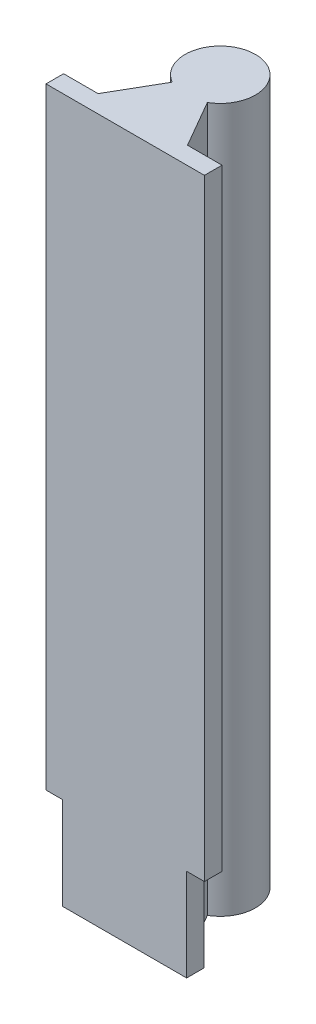
ISO-10303-21;
HEADER;
FILE_DESCRIPTION(('STEP AP214'),'2;1');
FILE_NAME('part.step','',(''),(''),'','','');
FILE_SCHEMA(('AUTOMOTIVE_DESIGN { 1 0 10303 214 1 1 1 1 }'));
ENDSEC;
DATA;
#1=APPLICATION_CONTEXT('core data for automotive mechanical design processes');
#2=APPLICATION_PROTOCOL_DEFINITION('international standard','automotive_design',2000,#1);
#3=PRODUCT_CONTEXT('',#1,'mechanical');
#4=PRODUCT('Part','Part','',(#3));
#5=PRODUCT_RELATED_PRODUCT_CATEGORY('part','',(#4));
#6=PRODUCT_DEFINITION_FORMATION('','',#4);
#7=PRODUCT_DEFINITION_CONTEXT('part definition',#1,'design');
#8=PRODUCT_DEFINITION('design','',#6,#7);
#9=PRODUCT_DEFINITION_SHAPE('','',#8);
#10=(LENGTH_UNIT() NAMED_UNIT(*) SI_UNIT(.MILLI.,.METRE.));
#11=(NAMED_UNIT(*) PLANE_ANGLE_UNIT() SI_UNIT($,.RADIAN.));
#12=(NAMED_UNIT(*) SI_UNIT($,.STERADIAN.) SOLID_ANGLE_UNIT());
#13=UNCERTAINTY_MEASURE_WITH_UNIT(LENGTH_MEASURE(1.E-05),#10,'distance_accuracy_value','');
#14=(GEOMETRIC_REPRESENTATION_CONTEXT(3) GLOBAL_UNCERTAINTY_ASSIGNED_CONTEXT((#13)) GLOBAL_UNIT_ASSIGNED_CONTEXT((#10,
#11,#12)) REPRESENTATION_CONTEXT('',''));
#15=CARTESIAN_POINT('',(0.,0.,0.));
#16=DIRECTION('',(0.,0.,1.));
#17=DIRECTION('',(1.,0.,0.));
#18=AXIS2_PLACEMENT_3D('',#15,#16,#17);
#19=CARTESIAN_POINT('',(-12.7017059221718,200.,-2.5));
#20=DIRECTION('',(0.,0.,1.));
#21=DIRECTION('',(1.,0.,0.));
#22=AXIS2_PLACEMENT_3D('',#19,#20,#21);
#23=PLANE('',#22);
#24=DIRECTION('',(-1.,0.,0.));
#25=VECTOR('',#24,1.);
#26=CARTESIAN_POINT('',(-12.7017059221718,0.,-2.5));
#27=LINE('',#26,#25);
#28=CARTESIAN_POINT('',(-12.7017059221718,0.,-2.5));
#29=VERTEX_POINT('',#28);
#30=CARTESIAN_POINT('',(-17.8840594454055,0.,-2.5));
#31=VERTEX_POINT('',#30);
#32=EDGE_CURVE('E160',#29,#31,#27,.T.);
#33=ORIENTED_EDGE('',*,*,#32,.T.);
#34=DIRECTION('',(0.,-1.,0.));
#35=VECTOR('',#34,1.);
#36=CARTESIAN_POINT('',(-17.8840594454055,-2.6813725433712,-2.5));
#37=LINE('',#36,#35);
#38=CARTESIAN_POINT('',(-17.8840594454055,26.2548562329599,-2.5));
#39=VERTEX_POINT('',#38);
#40=EDGE_CURVE('E54',#39,#31,#37,.T.);
#41=ORIENTED_EDGE('',*,*,#40,.F.);
#42=DIRECTION('',(1.,0.,0.));
#43=VECTOR('',#42,1.);
#44=CARTESIAN_POINT('',(-27.1159405545945,26.2548562329599,-2.5));
#45=LINE('',#44,#43);
#46=CARTESIAN_POINT('',(-22.5,26.2548562329599,-2.5));
#47=VERTEX_POINT('',#46);
#48=EDGE_CURVE('E150',#47,#39,#45,.T.);
#49=ORIENTED_EDGE('',*,*,#48,.F.);
#50=DIRECTION('',(0.,-1.,0.));
#51=VECTOR('',#50,1.);
#52=CARTESIAN_POINT('',(-22.5,200.,-2.5));
#53=LINE('',#52,#51);
#54=CARTESIAN_POINT('',(-22.5,200.,-2.5));
#55=VERTEX_POINT('',#54);
#56=EDGE_CURVE('E209',#55,#47,#53,.T.);
#57=ORIENTED_EDGE('',*,*,#56,.F.);
#58=DIRECTION('',(-1.,0.,0.));
#59=VECTOR('',#58,1.);
#60=CARTESIAN_POINT('',(-12.7017059221718,200.,-2.5));
#61=LINE('',#60,#59);
#62=CARTESIAN_POINT('',(-12.7017059221718,200.,-2.5));
#63=VERTEX_POINT('',#62);
#64=EDGE_CURVE('E161',#63,#55,#61,.T.);
#65=ORIENTED_EDGE('',*,*,#64,.F.);
#66=DIRECTION('',(0.,-1.,0.));
#67=VECTOR('',#66,1.);
#68=CARTESIAN_POINT('',(-12.7017059221718,200.,-2.5));
#69=LINE('',#68,#67);
#70=EDGE_CURVE('E179',#63,#29,#69,.T.);
#71=ORIENTED_EDGE('',*,*,#70,.T.);
#72=EDGE_LOOP('',(#33,#41,#49,#57,#65,#71));
#73=FACE_BOUND('',#72,.T.);
#74=ADVANCED_FACE('F33',(#73),#23,.F.);
#75=CARTESIAN_POINT('',(-22.5,200.,2.5));
#76=DIRECTION('',(1.,0.,0.));
#77=DIRECTION('',(0.,0.,-1.));
#78=AXIS2_PLACEMENT_3D('',#75,#76,#77);
#79=PLANE('',#78);
#80=ORIENTED_EDGE('',*,*,#56,.T.);
#81=DIRECTION('',(0.,0.,1.));
#82=VECTOR('',#81,1.);
#83=CARTESIAN_POINT('',(-22.5,26.2548562329599,2.5));
#84=LINE('',#83,#82);
#85=CARTESIAN_POINT('',(-22.5,26.2548562329599,2.5));
#86=VERTEX_POINT('',#85);
#87=EDGE_CURVE('E157',#47,#86,#84,.T.);
#88=ORIENTED_EDGE('',*,*,#87,.T.);
#89=DIRECTION('',(0.,-1.,0.));
#90=VECTOR('',#89,1.);
#91=CARTESIAN_POINT('',(-22.5,200.,2.5));
#92=LINE('',#91,#90);
#93=CARTESIAN_POINT('',(-22.5,200.,2.5));
#94=VERTEX_POINT('',#93);
#95=EDGE_CURVE('E206',#94,#86,#92,.T.);
#96=ORIENTED_EDGE('',*,*,#95,.F.);
#97=DIRECTION('',(0.,0.,1.));
#98=VECTOR('',#97,1.);
#99=CARTESIAN_POINT('',(-22.5,200.,2.5));
#100=LINE('',#99,#98);
#101=EDGE_CURVE('E164',#55,#94,#100,.T.);
#102=ORIENTED_EDGE('',*,*,#101,.F.);
#103=EDGE_LOOP('',(#80,#88,#96,#102));
#104=FACE_BOUND('',#103,.T.);
#105=ADVANCED_FACE('F248',(#104),#79,.F.);
#106=CARTESIAN_POINT('',(22.5,200.,2.5));
#107=DIRECTION('',(0.,0.,-1.));
#108=DIRECTION('',(-1.,0.,0.));
#109=AXIS2_PLACEMENT_3D('',#106,#107,#108);
#110=PLANE('',#109);
#111=DIRECTION('',(1.,0.,0.));
#112=VECTOR('',#111,1.);
#113=CARTESIAN_POINT('',(22.5,0.,2.5));
#114=LINE('',#113,#112);
#115=CARTESIAN_POINT('',(-17.8840594454055,0.,2.5));
#116=VERTEX_POINT('',#115);
#117=CARTESIAN_POINT('',(17.4535805631937,0.,2.5));
#118=VERTEX_POINT('',#117);
#119=EDGE_CURVE('E140',#116,#118,#114,.T.);
#120=ORIENTED_EDGE('',*,*,#119,.T.);
#121=DIRECTION('',(0.,1.,0.));
#122=VECTOR('',#121,1.);
#123=CARTESIAN_POINT('',(17.4535805631937,-2.6813725433712,2.50000000000001));
#124=LINE('',#123,#122);
#125=CARTESIAN_POINT('',(17.4535805631937,26.2548562329599,2.50000000000001));
#126=VERTEX_POINT('',#125);
#127=EDGE_CURVE('E47',#118,#126,#124,.T.);
#128=ORIENTED_EDGE('',*,*,#127,.T.);
#129=DIRECTION('',(1.,0.,0.));
#130=VECTOR('',#129,1.);
#131=CARTESIAN_POINT('',(27.5464194368063,26.2548562329599,2.50000000000001));
#132=LINE('',#131,#130);
#133=CARTESIAN_POINT('',(22.5,26.2548562329599,2.50000000000001));
#134=VERTEX_POINT('',#133);
#135=EDGE_CURVE('E127',#126,#134,#132,.T.);
#136=ORIENTED_EDGE('',*,*,#135,.T.);
#137=DIRECTION('',(0.,-1.,0.));
#138=VECTOR('',#137,1.);
#139=CARTESIAN_POINT('',(22.5,200.,2.5));
#140=LINE('',#139,#138);
#141=CARTESIAN_POINT('',(22.5,200.,2.5));
#142=VERTEX_POINT('',#141);
#143=EDGE_CURVE('E204',#142,#134,#140,.T.);
#144=ORIENTED_EDGE('',*,*,#143,.F.);
#145=DIRECTION('',(1.,0.,0.));
#146=VECTOR('',#145,1.);
#147=CARTESIAN_POINT('',(22.5,200.,2.5));
#148=LINE('',#147,#146);
#149=EDGE_CURVE('E167',#94,#142,#148,.T.);
#150=ORIENTED_EDGE('',*,*,#149,.F.);
#151=ORIENTED_EDGE('',*,*,#95,.T.);
#152=DIRECTION('',(1.,0.,0.));
#153=VECTOR('',#152,1.);
#154=CARTESIAN_POINT('',(-27.1159405545945,26.2548562329599,2.5));
#155=LINE('',#154,#153);
#156=CARTESIAN_POINT('',(-17.8840594454055,26.2548562329599,2.5));
#157=VERTEX_POINT('',#156);
#158=EDGE_CURVE('E149',#86,#157,#155,.T.);
#159=ORIENTED_EDGE('',*,*,#158,.T.);
#160=DIRECTION('',(0.,-1.,0.));
#161=VECTOR('',#160,1.);
#162=CARTESIAN_POINT('',(-17.8840594454055,-2.6813725433712,2.5));
#163=LINE('',#162,#161);
#164=EDGE_CURVE('E147',#157,#116,#163,.T.);
#165=ORIENTED_EDGE('',*,*,#164,.T.);
#166=EDGE_LOOP('',(#120,#128,#136,#144,#150,#151,#159,#165));
#167=FACE_BOUND('',#166,.T.);
#168=ADVANCED_FACE('F137',(#167),#110,.F.);
#169=CARTESIAN_POINT('',(22.5,200.,2.5));
#170=DIRECTION('',(-1.,0.,0.));
#171=DIRECTION('',(0.,0.,1.));
#172=AXIS2_PLACEMENT_3D('',#169,#170,#171);
#173=PLANE('',#172);
#174=ORIENTED_EDGE('',*,*,#143,.T.);
#175=DIRECTION('',(0.,0.,-1.));
#176=VECTOR('',#175,1.);
#177=CARTESIAN_POINT('',(22.5,26.2548562329599,2.5));
#178=LINE('',#177,#176);
#179=CARTESIAN_POINT('',(22.5,26.2548562329599,-2.49999999999999));
#180=VERTEX_POINT('',#179);
#181=EDGE_CURVE('E126',#134,#180,#178,.T.);
#182=ORIENTED_EDGE('',*,*,#181,.T.);
#183=DIRECTION('',(0.,-1.,0.));
#184=VECTOR('',#183,1.);
#185=CARTESIAN_POINT('',(22.5,200.,-2.5));
#186=LINE('',#185,#184);
#187=CARTESIAN_POINT('',(22.5,200.,-2.5));
#188=VERTEX_POINT('',#187);
#189=EDGE_CURVE('E201',#188,#180,#186,.T.);
#190=ORIENTED_EDGE('',*,*,#189,.F.);
#191=DIRECTION('',(0.,0.,-1.));
#192=VECTOR('',#191,1.);
#193=CARTESIAN_POINT('',(22.5,200.,2.5));
#194=LINE('',#193,#192);
#195=EDGE_CURVE('E169',#142,#188,#194,.T.);
#196=ORIENTED_EDGE('',*,*,#195,.F.);
#197=EDGE_LOOP('',(#174,#182,#190,#196));
#198=FACE_BOUND('',#197,.T.);
#199=ADVANCED_FACE('F241',(#198),#173,.F.);
#200=CARTESIAN_POINT('',(22.5,200.,-2.5));
#201=DIRECTION('',(0.,0.,1.));
#202=DIRECTION('',(1.,0.,0.));
#203=AXIS2_PLACEMENT_3D('',#200,#201,#202);
#204=PLANE('',#203);
#205=DIRECTION('',(1.,0.,0.));
#206=VECTOR('',#205,1.);
#207=CARTESIAN_POINT('',(27.5464194368063,26.2548562329599,-2.49999999999999));
#208=LINE('',#207,#206);
#209=CARTESIAN_POINT('',(17.4535805631937,26.2548562329599,-2.49999999999999));
#210=VERTEX_POINT('',#209);
#211=EDGE_CURVE('E141',#210,#180,#208,.T.);
#212=ORIENTED_EDGE('',*,*,#211,.F.);
#213=DIRECTION('',(0.,1.,0.));
#214=VECTOR('',#213,1.);
#215=CARTESIAN_POINT('',(17.4535805631937,-2.6813725433712,-2.49999999999999));
#216=LINE('',#215,#214);
#217=CARTESIAN_POINT('',(17.4535805631937,0.,-2.49999999999999));
#218=VERTEX_POINT('',#217);
#219=EDGE_CURVE('E123',#218,#210,#216,.T.);
#220=ORIENTED_EDGE('',*,*,#219,.F.);
#221=DIRECTION('',(-1.,0.,0.));
#222=VECTOR('',#221,1.);
#223=CARTESIAN_POINT('',(22.5,0.,-2.5));
#224=LINE('',#223,#222);
#225=CARTESIAN_POINT('',(12.7017059221718,0.,-2.5));
#226=VERTEX_POINT('',#225);
#227=EDGE_CURVE('E183',#218,#226,#224,.T.);
#228=ORIENTED_EDGE('',*,*,#227,.T.);
#229=DIRECTION('',(0.,-1.,0.));
#230=VECTOR('',#229,1.);
#231=CARTESIAN_POINT('',(12.7017059221718,200.,-2.5));
#232=LINE('',#231,#230);
#233=CARTESIAN_POINT('',(12.7017059221718,200.,-2.5));
#234=VERTEX_POINT('',#233);
#235=EDGE_CURVE('E198',#234,#226,#232,.T.);
#236=ORIENTED_EDGE('',*,*,#235,.F.);
#237=DIRECTION('',(-1.,0.,0.));
#238=VECTOR('',#237,1.);
#239=CARTESIAN_POINT('',(22.5,200.,-2.5));
#240=LINE('',#239,#238);
#241=EDGE_CURVE('E171',#188,#234,#240,.T.);
#242=ORIENTED_EDGE('',*,*,#241,.F.);
#243=ORIENTED_EDGE('',*,*,#189,.T.);
#244=EDGE_LOOP('',(#212,#220,#228,#236,#242,#243));
#245=FACE_BOUND('',#244,.T.);
#246=ADVANCED_FACE('F238',(#245),#204,.F.);
#247=CARTESIAN_POINT('',(5.00000000000002,200.,-15.8397459621556));
#248=DIRECTION('',(-0.866025403784438,0.,0.500000000000001));
#249=DIRECTION('',(0.500000000000001,0.,0.866025403784438));
#250=AXIS2_PLACEMENT_3D('',#247,#248,#249);
#251=PLANE('',#250);
#252=DIRECTION('',(-0.500000000000001,0.,-0.866025403784438));
#253=VECTOR('',#252,1.);
#254=CARTESIAN_POINT('',(5.00000000000002,0.,-15.8397459621556));
#255=LINE('',#254,#253);
#256=CARTESIAN_POINT('',(5.00000000000002,0.,-15.8397459621556));
#257=VERTEX_POINT('',#256);
#258=EDGE_CURVE('E185',#226,#257,#255,.T.);
#259=ORIENTED_EDGE('',*,*,#258,.T.);
#260=DIRECTION('',(0.,-1.,0.));
#261=VECTOR('',#260,1.);
#262=CARTESIAN_POINT('',(5.00000000000002,200.,-15.8397459621556));
#263=LINE('',#262,#261);
#264=CARTESIAN_POINT('',(5.00000000000002,200.,-15.8397459621556));
#265=VERTEX_POINT('',#264);
#266=EDGE_CURVE('E195',#265,#257,#263,.T.);
#267=ORIENTED_EDGE('',*,*,#266,.F.);
#268=DIRECTION('',(-0.500000000000001,0.,-0.866025403784438));
#269=VECTOR('',#268,1.);
#270=CARTESIAN_POINT('',(5.00000000000002,200.,-15.8397459621556));
#271=LINE('',#270,#269);
#272=EDGE_CURVE('E173',#234,#265,#271,.T.);
#273=ORIENTED_EDGE('',*,*,#272,.F.);
#274=ORIENTED_EDGE('',*,*,#235,.T.);
#275=EDGE_LOOP('',(#259,#267,#273,#274));
#276=FACE_BOUND('',#275,.T.);
#277=ADVANCED_FACE('F234',(#276),#251,.F.);
#278=CARTESIAN_POINT('',(0.,200.,-24.5));
#279=DIRECTION('',(0.,-1.,0.));
#280=DIRECTION('',(0.,0.,-1.));
#281=AXIS2_PLACEMENT_3D('',#278,#279,#280);
#282=CYLINDRICAL_SURFACE('',#281,10.);
#283=CARTESIAN_POINT('',(0.,0.,-24.5));
#284=DIRECTION('',(0.,1.,0.));
#285=DIRECTION('',(0.,0.,1.));
#286=AXIS2_PLACEMENT_3D('',#283,#284,#285);
#287=CIRCLE('',#286,10.);
#288=CARTESIAN_POINT('',(-5.00000000000002,0.,-15.8397459621556));
#289=VERTEX_POINT('',#288);
#290=EDGE_CURVE('E187',#257,#289,#287,.T.);
#291=ORIENTED_EDGE('',*,*,#290,.T.);
#292=DIRECTION('',(0.,-1.,0.));
#293=VECTOR('',#292,1.);
#294=CARTESIAN_POINT('',(-5.00000000000002,200.,-15.8397459621556));
#295=LINE('',#294,#293);
#296=CARTESIAN_POINT('',(-5.00000000000002,200.,-15.8397459621556));
#297=VERTEX_POINT('',#296);
#298=EDGE_CURVE('E192',#297,#289,#295,.T.);
#299=ORIENTED_EDGE('',*,*,#298,.F.);
#300=CARTESIAN_POINT('',(0.,200.,-24.5));
#301=DIRECTION('',(0.,1.,0.));
#302=DIRECTION('',(0.,0.,1.));
#303=AXIS2_PLACEMENT_3D('',#300,#301,#302);
#304=CIRCLE('',#303,10.);
#305=EDGE_CURVE('E175',#265,#297,#304,.T.);
#306=ORIENTED_EDGE('',*,*,#305,.F.);
#307=ORIENTED_EDGE('',*,*,#266,.T.);
#308=EDGE_LOOP('',(#291,#299,#306,#307));
#309=FACE_BOUND('',#308,.T.);
#310=ADVANCED_FACE('F229',(#309),#282,.T.);
#311=CARTESIAN_POINT('',(-5.00000000000001,200.,-15.8397459621556));
#312=DIRECTION('',(0.866025403784438,0.,0.500000000000001));
#313=DIRECTION('',(0.500000000000001,0.,-0.866025403784438));
#314=AXIS2_PLACEMENT_3D('',#311,#312,#313);
#315=PLANE('',#314);
#316=DIRECTION('',(-0.500000000000001,0.,0.866025403784438));
#317=VECTOR('',#316,1.);
#318=CARTESIAN_POINT('',(-5.00000000000001,0.,-15.8397459621556));
#319=LINE('',#318,#317);
#320=EDGE_CURVE('E165',#289,#29,#319,.T.);
#321=ORIENTED_EDGE('',*,*,#320,.T.);
#322=ORIENTED_EDGE('',*,*,#70,.F.);
#323=DIRECTION('',(-0.500000000000001,0.,0.866025403784438));
#324=VECTOR('',#323,1.);
#325=CARTESIAN_POINT('',(-5.00000000000001,200.,-15.8397459621556));
#326=LINE('',#325,#324);
#327=EDGE_CURVE('E177',#297,#63,#326,.T.);
#328=ORIENTED_EDGE('',*,*,#327,.F.);
#329=ORIENTED_EDGE('',*,*,#298,.T.);
#330=EDGE_LOOP('',(#321,#322,#328,#329));
#331=FACE_BOUND('',#330,.T.);
#332=ADVANCED_FACE('F224',(#331),#315,.F.);
#333=CARTESIAN_POINT('',(0.,200.,-24.5));
#334=DIRECTION('',(0.,1.,0.));
#335=DIRECTION('',(0.,0.,1.));
#336=AXIS2_PLACEMENT_3D('',#333,#334,#335);
#337=PLANE('',#336);
#338=ORIENTED_EDGE('',*,*,#64,.T.);
#339=ORIENTED_EDGE('',*,*,#101,.T.);
#340=ORIENTED_EDGE('',*,*,#149,.T.);
#341=ORIENTED_EDGE('',*,*,#195,.T.);
#342=ORIENTED_EDGE('',*,*,#241,.T.);
#343=ORIENTED_EDGE('',*,*,#272,.T.);
#344=ORIENTED_EDGE('',*,*,#305,.T.);
#345=ORIENTED_EDGE('',*,*,#327,.T.);
#346=EDGE_LOOP('',(#338,#339,#340,#341,#342,#343,#344,#345));
#347=FACE_BOUND('',#346,.T.);
#348=ADVANCED_FACE('F246',(#347),#337,.T.);
#349=CARTESIAN_POINT('',(0.,0.,-24.5));
#350=DIRECTION('',(0.,1.,0.));
#351=DIRECTION('',(0.,0.,1.));
#352=AXIS2_PLACEMENT_3D('',#349,#350,#351);
#353=PLANE('',#352);
#354=ORIENTED_EDGE('',*,*,#227,.F.);
#355=DIRECTION('',(0.,0.,1.));
#356=VECTOR('',#355,1.);
#357=CARTESIAN_POINT('',(17.4535805631937,0.,-24.5));
#358=LINE('',#357,#356);
#359=EDGE_CURVE('E11',#218,#118,#358,.T.);
#360=ORIENTED_EDGE('',*,*,#359,.T.);
#361=ORIENTED_EDGE('',*,*,#119,.F.);
#362=DIRECTION('',(0.,0.,-1.));
#363=VECTOR('',#362,1.);
#364=CARTESIAN_POINT('',(-17.8840594454055,0.,-24.5));
#365=LINE('',#364,#363);
#366=EDGE_CURVE('E40',#116,#31,#365,.T.);
#367=ORIENTED_EDGE('',*,*,#366,.T.);
#368=ORIENTED_EDGE('',*,*,#32,.F.);
#369=ORIENTED_EDGE('',*,*,#320,.F.);
#370=ORIENTED_EDGE('',*,*,#290,.F.);
#371=ORIENTED_EDGE('',*,*,#258,.F.);
#372=EDGE_LOOP('',(#354,#360,#361,#367,#368,#369,#370,#371));
#373=FACE_BOUND('',#372,.T.);
#374=ADVANCED_FACE('F214',(#373),#353,.F.);
#375=CARTESIAN_POINT('',(-27.1159405545945,26.2548562329599,2.5));
#376=DIRECTION('',(0.,1.,0.));
#377=DIRECTION('',(0.,0.,1.));
#378=AXIS2_PLACEMENT_3D('',#375,#376,#377);
#379=PLANE('',#378);
#380=ORIENTED_EDGE('',*,*,#48,.T.);
#381=DIRECTION('',(0.,0.,-1.));
#382=VECTOR('',#381,1.);
#383=CARTESIAN_POINT('',(-17.8840594454055,26.2548562329599,2.5));
#384=LINE('',#383,#382);
#385=EDGE_CURVE('E153',#157,#39,#384,.T.);
#386=ORIENTED_EDGE('',*,*,#385,.F.);
#387=ORIENTED_EDGE('',*,*,#158,.F.);
#388=ORIENTED_EDGE('',*,*,#87,.F.);
#389=EDGE_LOOP('',(#380,#386,#387,#388));
#390=FACE_BOUND('',#389,.T.);
#391=ADVANCED_FACE('F250',(#390),#379,.F.);
#392=CARTESIAN_POINT('',(-17.8840594454055,-2.6813725433712,2.5));
#393=DIRECTION('',(1.,0.,0.));
#394=DIRECTION('',(0.,0.,-1.));
#395=AXIS2_PLACEMENT_3D('',#392,#393,#394);
#396=PLANE('',#395);
#397=ORIENTED_EDGE('',*,*,#164,.F.);
#398=ORIENTED_EDGE('',*,*,#385,.T.);
#399=ORIENTED_EDGE('',*,*,#40,.T.);
#400=ORIENTED_EDGE('',*,*,#366,.F.);
#401=EDGE_LOOP('',(#397,#398,#399,#400));
#402=FACE_BOUND('',#401,.T.);
#403=ADVANCED_FACE('F251',(#402),#396,.F.);
#404=CARTESIAN_POINT('',(27.5464194368063,26.2548562329599,2.50000000000001));
#405=DIRECTION('',(0.,1.,0.));
#406=DIRECTION('',(0.,0.,1.));
#407=AXIS2_PLACEMENT_3D('',#404,#405,#406);
#408=PLANE('',#407);
#409=ORIENTED_EDGE('',*,*,#135,.F.);
#410=DIRECTION('',(0.,0.,-1.));
#411=VECTOR('',#410,1.);
#412=CARTESIAN_POINT('',(17.4535805631937,26.2548562329599,2.50000000000001));
#413=LINE('',#412,#411);
#414=EDGE_CURVE('E119',#126,#210,#413,.T.);
#415=ORIENTED_EDGE('',*,*,#414,.T.);
#416=ORIENTED_EDGE('',*,*,#211,.T.);
#417=ORIENTED_EDGE('',*,*,#181,.F.);
#418=EDGE_LOOP('',(#409,#415,#416,#417));
#419=FACE_BOUND('',#418,.T.);
#420=ADVANCED_FACE('F130',(#419),#408,.F.);
#421=CARTESIAN_POINT('',(17.4535805631937,-2.6813725433712,2.50000000000001));
#422=DIRECTION('',(-1.,0.,0.));
#423=DIRECTION('',(0.,0.,1.));
#424=AXIS2_PLACEMENT_3D('',#421,#422,#423);
#425=PLANE('',#424);
#426=ORIENTED_EDGE('',*,*,#219,.T.);
#427=ORIENTED_EDGE('',*,*,#414,.F.);
#428=ORIENTED_EDGE('',*,*,#127,.F.);
#429=ORIENTED_EDGE('',*,*,#359,.F.);
#430=EDGE_LOOP('',(#426,#427,#428,#429));
#431=FACE_BOUND('',#430,.T.);
#432=ADVANCED_FACE('F121',(#431),#425,.F.);
#433=CLOSED_SHELL('',(#74,#105,#168,#199,#246,#277,#310,#332,#348,#374,#391,#403,#420,#432));
#434=MANIFOLD_SOLID_BREP('B2',#433);
#435=ADVANCED_BREP_SHAPE_REPRESENTATION('',(#18,#434),#14);
#436=SHAPE_DEFINITION_REPRESENTATION(#9,#435);
ENDSEC;
END-ISO-10303-21;
